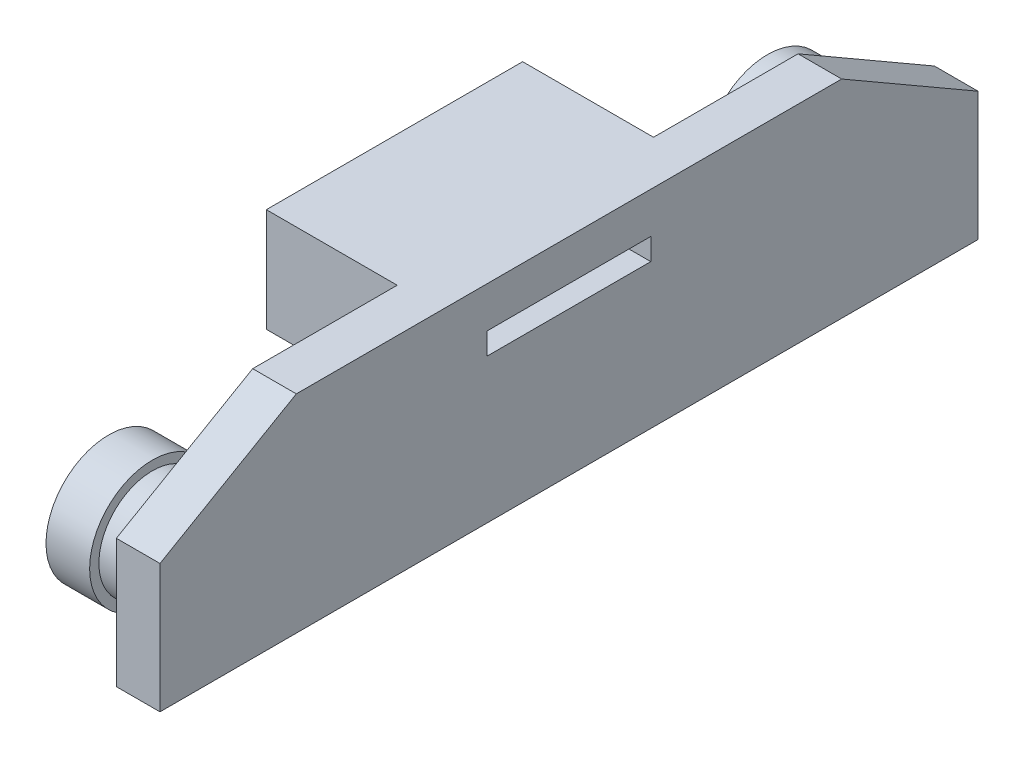
ISO-10303-21;
HEADER;
FILE_DESCRIPTION(('STEP AP214'),'2;1');
FILE_NAME('part.step','',(''),(''),'','','');
FILE_SCHEMA(('AUTOMOTIVE_DESIGN { 1 0 10303 214 1 1 1 1 }'));
ENDSEC;
DATA;
#1=APPLICATION_CONTEXT('core data for automotive mechanical design processes');
#2=APPLICATION_PROTOCOL_DEFINITION('international standard','automotive_design',2000,#1);
#3=PRODUCT_CONTEXT('',#1,'mechanical');
#4=PRODUCT('Part','Part','',(#3));
#5=PRODUCT_RELATED_PRODUCT_CATEGORY('part','',(#4));
#6=PRODUCT_DEFINITION_FORMATION('','',#4);
#7=PRODUCT_DEFINITION_CONTEXT('part definition',#1,'design');
#8=PRODUCT_DEFINITION('design','',#6,#7);
#9=PRODUCT_DEFINITION_SHAPE('','',#8);
#10=(LENGTH_UNIT() NAMED_UNIT(*) SI_UNIT(.MILLI.,.METRE.));
#11=(NAMED_UNIT(*) PLANE_ANGLE_UNIT() SI_UNIT($,.RADIAN.));
#12=(NAMED_UNIT(*) SI_UNIT($,.STERADIAN.) SOLID_ANGLE_UNIT());
#13=UNCERTAINTY_MEASURE_WITH_UNIT(LENGTH_MEASURE(1.E-05),#10,'distance_accuracy_value','');
#14=(GEOMETRIC_REPRESENTATION_CONTEXT(3) GLOBAL_UNCERTAINTY_ASSIGNED_CONTEXT((#13)) GLOBAL_UNIT_ASSIGNED_CONTEXT((#10,
#11,#12)) REPRESENTATION_CONTEXT('',''));
#15=CARTESIAN_POINT('',(0.,0.,0.));
#16=DIRECTION('',(0.,0.,1.));
#17=DIRECTION('',(1.,0.,0.));
#18=AXIS2_PLACEMENT_3D('',#15,#16,#17);
#19=CARTESIAN_POINT('',(-2.032,-1.94510300719157,7.6708));
#20=DIRECTION('',(-1.,0.,0.));
#21=DIRECTION('',(0.,0.,1.));
#22=AXIS2_PLACEMENT_3D('',#19,#20,#21);
#23=PLANE('',#22);
#24=CARTESIAN_POINT('',(-2.032,-1.94510300719157,7.6708));
#25=DIRECTION('',(-1.,0.,0.));
#26=DIRECTION('',(0.,0.,1.));
#27=AXIS2_PLACEMENT_3D('',#24,#25,#26);
#28=CIRCLE('',#27,1.4605);
#29=CARTESIAN_POINT('',(-2.032,-1.94510300719157,9.1313));
#30=VERTEX_POINT('',#29);
#31=EDGE_CURVE('E20',#30,#30,#28,.F.);
#32=ORIENTED_EDGE('',*,*,#31,.F.);
#33=EDGE_LOOP('',(#32));
#34=FACE_BOUND('',#33,.T.);
#35=ADVANCED_FACE('F17',(#34),#23,.T.);
#36=CARTESIAN_POINT('',(-2.032,-1.94510300719157,-7.6708));
#37=DIRECTION('',(-1.,0.,0.));
#38=DIRECTION('',(0.,0.,1.));
#39=AXIS2_PLACEMENT_3D('',#36,#37,#38);
#40=PLANE('',#39);
#41=CARTESIAN_POINT('',(-2.032,-1.94510300719157,-7.6708));
#42=DIRECTION('',(-1.,0.,0.));
#43=DIRECTION('',(0.,0.,1.));
#44=AXIS2_PLACEMENT_3D('',#41,#42,#43);
#45=CIRCLE('',#44,1.4605);
#46=CARTESIAN_POINT('',(-2.032,-1.94510300719157,-6.2103));
#47=VERTEX_POINT('',#46);
#48=EDGE_CURVE('E169',#47,#47,#45,.F.);
#49=ORIENTED_EDGE('',*,*,#48,.F.);
#50=EDGE_LOOP('',(#49));
#51=FACE_BOUND('',#50,.T.);
#52=ADVANCED_FACE('F180',(#51),#40,.T.);
#53=CARTESIAN_POINT('',(-1.016,-1.94510300719157,7.6708));
#54=DIRECTION('',(-1.,0.,0.));
#55=DIRECTION('',(0.,0.,1.));
#56=AXIS2_PLACEMENT_3D('',#53,#54,#55);
#57=CYLINDRICAL_SURFACE('',#56,1.4605);
#58=ORIENTED_EDGE('',*,*,#31,.T.);
#59=EDGE_LOOP('',(#58));
#60=FACE_BOUND('',#59,.T.);
#61=CARTESIAN_POINT('',(-1.016,-1.94510300719157,7.6708));
#62=DIRECTION('',(-1.,0.,0.));
#63=DIRECTION('',(0.,0.,1.));
#64=AXIS2_PLACEMENT_3D('',#61,#62,#63);
#65=CIRCLE('',#64,1.4605);
#66=CARTESIAN_POINT('',(-1.016,-1.94510300719157,9.1313));
#67=VERTEX_POINT('',#66);
#68=EDGE_CURVE('E167',#67,#67,#65,.T.);
#69=ORIENTED_EDGE('',*,*,#68,.T.);
#70=EDGE_LOOP('',(#69));
#71=FACE_BOUND('',#70,.T.);
#72=ADVANCED_FACE('F176',(#60,#71),#57,.T.);
#73=CARTESIAN_POINT('',(-1.016,-1.94510300719157,-7.6708));
#74=DIRECTION('',(-1.,0.,0.));
#75=DIRECTION('',(0.,0.,1.));
#76=AXIS2_PLACEMENT_3D('',#73,#74,#75);
#77=CYLINDRICAL_SURFACE('',#76,1.4605);
#78=ORIENTED_EDGE('',*,*,#48,.T.);
#79=EDGE_LOOP('',(#78));
#80=FACE_BOUND('',#79,.T.);
#81=CARTESIAN_POINT('',(-1.016,-1.94510300719157,-7.6708));
#82=DIRECTION('',(-1.,0.,0.));
#83=DIRECTION('',(0.,0.,1.));
#84=AXIS2_PLACEMENT_3D('',#81,#82,#83);
#85=CIRCLE('',#84,1.4605);
#86=CARTESIAN_POINT('',(-1.016,-1.94510300719157,-6.2103));
#87=VERTEX_POINT('',#86);
#88=EDGE_CURVE('E164',#87,#87,#85,.T.);
#89=ORIENTED_EDGE('',*,*,#88,.T.);
#90=EDGE_LOOP('',(#89));
#91=FACE_BOUND('',#90,.T.);
#92=ADVANCED_FACE('F263',(#80,#91),#77,.T.);
#93=CARTESIAN_POINT('',(-1.016,-1.94510300719157,7.6708));
#94=DIRECTION('',(-1.,0.,0.));
#95=DIRECTION('',(0.,0.,1.));
#96=AXIS2_PLACEMENT_3D('',#93,#94,#95);
#97=PLANE('',#96);
#98=ORIENTED_EDGE('',*,*,#68,.F.);
#99=EDGE_LOOP('',(#98));
#100=FACE_BOUND('',#99,.T.);
#101=CARTESIAN_POINT('',(-1.016,-1.94510300719157,7.6708));
#102=DIRECTION('',(1.,0.,0.));
#103=DIRECTION('',(0.,0.,-1.));
#104=AXIS2_PLACEMENT_3D('',#101,#102,#103);
#105=CIRCLE('',#104,1.2446);
#106=CARTESIAN_POINT('',(-1.016,-1.94510300719157,6.42619999999999));
#107=VERTEX_POINT('',#106);
#108=EDGE_CURVE('E161',#107,#107,#105,.T.);
#109=ORIENTED_EDGE('',*,*,#108,.F.);
#110=EDGE_LOOP('',(#109));
#111=FACE_BOUND('',#110,.T.);
#112=ADVANCED_FACE('F259',(#100,#111),#97,.F.);
#113=CARTESIAN_POINT('',(-1.016,-1.94510300719157,-7.6708));
#114=DIRECTION('',(-1.,0.,0.));
#115=DIRECTION('',(0.,0.,1.));
#116=AXIS2_PLACEMENT_3D('',#113,#114,#115);
#117=PLANE('',#116);
#118=ORIENTED_EDGE('',*,*,#88,.F.);
#119=EDGE_LOOP('',(#118));
#120=FACE_BOUND('',#119,.T.);
#121=CARTESIAN_POINT('',(-1.016,-1.94510300719157,-7.6708));
#122=DIRECTION('',(1.,0.,0.));
#123=DIRECTION('',(0.,0.,-1.));
#124=AXIS2_PLACEMENT_3D('',#121,#122,#123);
#125=CIRCLE('',#124,1.2446);
#126=CARTESIAN_POINT('',(-1.016,-1.94510300719157,-8.9154));
#127=VERTEX_POINT('',#126);
#128=EDGE_CURVE('E152',#127,#127,#125,.T.);
#129=ORIENTED_EDGE('',*,*,#128,.F.);
#130=EDGE_LOOP('',(#129));
#131=FACE_BOUND('',#130,.T.);
#132=ADVANCED_FACE('F255',(#120,#131),#117,.F.);
#133=CARTESIAN_POINT('',(-3.048,-1.94510300719157,7.6708));
#134=DIRECTION('',(1.,0.,0.));
#135=DIRECTION('',(0.,0.,-1.));
#136=AXIS2_PLACEMENT_3D('',#133,#134,#135);
#137=CYLINDRICAL_SURFACE('',#136,1.2446);
#138=CARTESIAN_POINT('',(0.,-1.94510300719157,7.6708));
#139=DIRECTION('',(1.,0.,0.));
#140=DIRECTION('',(0.,0.,-1.));
#141=AXIS2_PLACEMENT_3D('',#138,#139,#140);
#142=CIRCLE('',#141,1.2446);
#143=CARTESIAN_POINT('',(0.,-1.94510300719157,6.42619999999999));
#144=VERTEX_POINT('',#143);
#145=EDGE_CURVE('E156',#144,#144,#142,.F.);
#146=ORIENTED_EDGE('',*,*,#145,.T.);
#147=EDGE_LOOP('',(#146));
#148=FACE_BOUND('',#147,.T.);
#149=ORIENTED_EDGE('',*,*,#108,.T.);
#150=EDGE_LOOP('',(#149));
#151=FACE_BOUND('',#150,.T.);
#152=ADVANCED_FACE('F251',(#148,#151),#137,.T.);
#153=CARTESIAN_POINT('',(-3.048,-1.94510300719157,-7.6708));
#154=DIRECTION('',(1.,0.,0.));
#155=DIRECTION('',(0.,0.,-1.));
#156=AXIS2_PLACEMENT_3D('',#153,#154,#155);
#157=CYLINDRICAL_SURFACE('',#156,1.2446);
#158=CARTESIAN_POINT('',(0.,-1.94510300719157,-7.6708));
#159=DIRECTION('',(1.,0.,0.));
#160=DIRECTION('',(0.,0.,-1.));
#161=AXIS2_PLACEMENT_3D('',#158,#159,#160);
#162=CIRCLE('',#161,1.2446);
#163=CARTESIAN_POINT('',(0.,-1.94510300719157,-8.9154));
#164=VERTEX_POINT('',#163);
#165=EDGE_CURVE('E153',#164,#164,#162,.F.);
#166=ORIENTED_EDGE('',*,*,#165,.T.);
#167=EDGE_LOOP('',(#166));
#168=FACE_BOUND('',#167,.T.);
#169=ORIENTED_EDGE('',*,*,#128,.T.);
#170=EDGE_LOOP('',(#169));
#171=FACE_BOUND('',#170,.T.);
#172=ADVANCED_FACE('F248',(#168,#171),#157,.T.);
#173=CARTESIAN_POINT('',(-3.048,-1.2065,2.9845));
#174=DIRECTION('',(0.,-1.,0.));
#175=DIRECTION('',(0.,0.,-1.));
#176=AXIS2_PLACEMENT_3D('',#173,#174,#175);
#177=PLANE('',#176);
#178=DIRECTION('',(0.,0.,-1.));
#179=VECTOR('',#178,1.);
#180=CARTESIAN_POINT('',(-3.048,-1.2065,-2.9845));
#181=LINE('',#180,#179);
#182=CARTESIAN_POINT('',(-3.048,-1.2065,2.9845));
#183=VERTEX_POINT('',#182);
#184=CARTESIAN_POINT('',(-3.048,-1.2065,-2.9845));
#185=VERTEX_POINT('',#184);
#186=EDGE_CURVE('E115',#183,#185,#181,.T.);
#187=ORIENTED_EDGE('',*,*,#186,.T.);
#188=DIRECTION('',(-1.,0.,0.));
#189=VECTOR('',#188,1.);
#190=CARTESIAN_POINT('',(-3.048,-1.2065,-2.9845));
#191=LINE('',#190,#189);
#192=CARTESIAN_POINT('',(0.,-1.2065,-2.9845));
#193=VERTEX_POINT('',#192);
#194=EDGE_CURVE('E120',#193,#185,#191,.T.);
#195=ORIENTED_EDGE('',*,*,#194,.F.);
#196=DIRECTION('',(0.,0.,-1.));
#197=VECTOR('',#196,1.);
#198=CARTESIAN_POINT('',(0.,-1.2065,9.52499999999999));
#199=LINE('',#198,#197);
#200=CARTESIAN_POINT('',(0.,-1.2065,2.9845));
#201=VERTEX_POINT('',#200);
#202=EDGE_CURVE('E502',#193,#201,#199,.F.);
#203=ORIENTED_EDGE('',*,*,#202,.T.);
#204=DIRECTION('',(1.,0.,0.));
#205=VECTOR('',#204,1.);
#206=CARTESIAN_POINT('',(-3.048,-1.2065,2.9845));
#207=LINE('',#206,#205);
#208=EDGE_CURVE('E123',#183,#201,#207,.T.);
#209=ORIENTED_EDGE('',*,*,#208,.F.);
#210=EDGE_LOOP('',(#187,#195,#203,#209));
#211=FACE_BOUND('',#210,.T.);
#212=ADVANCED_FACE('F119',(#211),#177,.T.);
#213=CARTESIAN_POINT('',(1.016,-0.254,-1.905));
#214=DIRECTION('',(0.,0.,-1.));
#215=DIRECTION('',(-1.,0.,0.));
#216=AXIS2_PLACEMENT_3D('',#213,#214,#215);
#217=PLANE('',#216);
#218=DIRECTION('',(1.,0.,0.));
#219=VECTOR('',#218,1.);
#220=CARTESIAN_POINT('',(1.016,-0.254,-1.905));
#221=LINE('',#220,#219);
#222=CARTESIAN_POINT('',(-3.048,-0.254,-1.905));
#223=VERTEX_POINT('',#222);
#224=CARTESIAN_POINT('',(1.016,-0.254,-1.905));
#225=VERTEX_POINT('',#224);
#226=EDGE_CURVE('E430',#223,#225,#221,.T.);
#227=ORIENTED_EDGE('',*,*,#226,.T.);
#228=DIRECTION('',(0.,1.,0.));
#229=VECTOR('',#228,1.);
#230=CARTESIAN_POINT('',(1.016,-0.254,-1.905));
#231=LINE('',#230,#229);
#232=CARTESIAN_POINT('',(1.016,0.254,-1.905));
#233=VERTEX_POINT('',#232);
#234=EDGE_CURVE('E150',#233,#225,#231,.F.);
#235=ORIENTED_EDGE('',*,*,#234,.F.);
#236=DIRECTION('',(1.,0.,0.));
#237=VECTOR('',#236,1.);
#238=CARTESIAN_POINT('',(1.016,0.254,-1.905));
#239=LINE('',#238,#237);
#240=CARTESIAN_POINT('',(-3.048,0.254,-1.905));
#241=VERTEX_POINT('',#240);
#242=EDGE_CURVE('E495',#233,#241,#239,.F.);
#243=ORIENTED_EDGE('',*,*,#242,.T.);
#244=DIRECTION('',(0.,1.,0.));
#245=VECTOR('',#244,1.);
#246=CARTESIAN_POINT('',(-3.048,-1.2065,-1.905));
#247=LINE('',#246,#245);
#248=EDGE_CURVE('E134',#241,#223,#247,.F.);
#249=ORIENTED_EDGE('',*,*,#248,.T.);
#250=EDGE_LOOP('',(#227,#235,#243,#249));
#251=FACE_BOUND('',#250,.T.);
#252=ADVANCED_FACE('F241',(#251),#217,.F.);
#253=CARTESIAN_POINT('',(1.016,-0.254,1.905));
#254=DIRECTION('',(0.,0.,1.));
#255=DIRECTION('',(1.,0.,0.));
#256=AXIS2_PLACEMENT_3D('',#253,#254,#255);
#257=PLANE('',#256);
#258=DIRECTION('',(1.,0.,0.));
#259=VECTOR('',#258,1.);
#260=CARTESIAN_POINT('',(1.016,0.254,1.905));
#261=LINE('',#260,#259);
#262=CARTESIAN_POINT('',(-3.048,0.254,1.905));
#263=VERTEX_POINT('',#262);
#264=CARTESIAN_POINT('',(1.016,0.254,1.905));
#265=VERTEX_POINT('',#264);
#266=EDGE_CURVE('E497',#263,#265,#261,.T.);
#267=ORIENTED_EDGE('',*,*,#266,.T.);
#268=DIRECTION('',(0.,1.,0.));
#269=VECTOR('',#268,1.);
#270=CARTESIAN_POINT('',(1.016,-0.254,1.905));
#271=LINE('',#270,#269);
#272=CARTESIAN_POINT('',(1.016,-0.254,1.905));
#273=VERTEX_POINT('',#272);
#274=EDGE_CURVE('E135',#273,#265,#271,.T.);
#275=ORIENTED_EDGE('',*,*,#274,.F.);
#276=DIRECTION('',(1.,0.,0.));
#277=VECTOR('',#276,1.);
#278=CARTESIAN_POINT('',(1.016,-0.254,1.905));
#279=LINE('',#278,#277);
#280=CARTESIAN_POINT('',(-3.048,-0.254,1.905));
#281=VERTEX_POINT('',#280);
#282=EDGE_CURVE('E436',#273,#281,#279,.F.);
#283=ORIENTED_EDGE('',*,*,#282,.T.);
#284=DIRECTION('',(0.,1.,0.));
#285=VECTOR('',#284,1.);
#286=CARTESIAN_POINT('',(-3.048,-1.2065,1.905));
#287=LINE('',#286,#285);
#288=EDGE_CURVE('E126',#281,#263,#287,.T.);
#289=ORIENTED_EDGE('',*,*,#288,.T.);
#290=EDGE_LOOP('',(#267,#275,#283,#289));
#291=FACE_BOUND('',#290,.T.);
#292=ADVANCED_FACE('F238',(#291),#257,.F.);
#293=CARTESIAN_POINT('',(-3.048,1.2065,-2.9845));
#294=DIRECTION('',(0.,0.,-1.));
#295=DIRECTION('',(-1.,0.,0.));
#296=AXIS2_PLACEMENT_3D('',#293,#294,#295);
#297=PLANE('',#296);
#298=DIRECTION('',(0.,1.,0.));
#299=VECTOR('',#298,1.);
#300=CARTESIAN_POINT('',(-3.048,-1.2065,-2.9845));
#301=LINE('',#300,#299);
#302=CARTESIAN_POINT('',(-3.048,1.2065,-2.9845));
#303=VERTEX_POINT('',#302);
#304=EDGE_CURVE('E125',#185,#303,#301,.T.);
#305=ORIENTED_EDGE('',*,*,#304,.T.);
#306=DIRECTION('',(1.,0.,0.));
#307=VECTOR('',#306,1.);
#308=CARTESIAN_POINT('',(-3.048,1.2065,-2.9845));
#309=LINE('',#308,#307);
#310=CARTESIAN_POINT('',(0.,1.2065,-2.9845));
#311=VERTEX_POINT('',#310);
#312=EDGE_CURVE('E475',#311,#303,#309,.F.);
#313=ORIENTED_EDGE('',*,*,#312,.F.);
#314=DIRECTION('',(0.,1.,0.));
#315=VECTOR('',#314,1.);
#316=CARTESIAN_POINT('',(0.,1.2065,-2.9845));
#317=LINE('',#316,#315);
#318=EDGE_CURVE('E132',#311,#193,#317,.F.);
#319=ORIENTED_EDGE('',*,*,#318,.T.);
#320=ORIENTED_EDGE('',*,*,#194,.T.);
#321=EDGE_LOOP('',(#305,#313,#319,#320));
#322=FACE_BOUND('',#321,.T.);
#323=ADVANCED_FACE('F129',(#322),#297,.T.);
#324=CARTESIAN_POINT('',(-3.048,-1.2065,-2.9845));
#325=DIRECTION('',(1.,0.,0.));
#326=DIRECTION('',(0.,0.,-1.));
#327=AXIS2_PLACEMENT_3D('',#324,#325,#326);
#328=PLANE('',#327);
#329=ORIENTED_EDGE('',*,*,#186,.F.);
#330=DIRECTION('',(0.,1.,0.));
#331=VECTOR('',#330,1.);
#332=CARTESIAN_POINT('',(-3.048,1.2065,2.9845));
#333=LINE('',#332,#331);
#334=CARTESIAN_POINT('',(-3.048,1.2065,2.9845));
#335=VERTEX_POINT('',#334);
#336=EDGE_CURVE('E142',#335,#183,#333,.F.);
#337=ORIENTED_EDGE('',*,*,#336,.F.);
#338=DIRECTION('',(0.,0.,1.));
#339=VECTOR('',#338,1.);
#340=CARTESIAN_POINT('',(-3.048,1.2065,2.9845));
#341=LINE('',#340,#339);
#342=EDGE_CURVE('E140',#303,#335,#341,.T.);
#343=ORIENTED_EDGE('',*,*,#342,.F.);
#344=ORIENTED_EDGE('',*,*,#304,.F.);
#345=EDGE_LOOP('',(#329,#337,#343,#344));
#346=FACE_BOUND('',#345,.T.);
#347=ORIENTED_EDGE('',*,*,#288,.F.);
#348=DIRECTION('',(0.,0.,-1.));
#349=VECTOR('',#348,1.);
#350=CARTESIAN_POINT('',(-3.048,-0.254,-1.905));
#351=LINE('',#350,#349);
#352=EDGE_CURVE('E490',#281,#223,#351,.T.);
#353=ORIENTED_EDGE('',*,*,#352,.T.);
#354=ORIENTED_EDGE('',*,*,#248,.F.);
#355=DIRECTION('',(0.,0.,1.));
#356=VECTOR('',#355,1.);
#357=CARTESIAN_POINT('',(-3.048,0.254,-1.905));
#358=LINE('',#357,#356);
#359=EDGE_CURVE('E437',#241,#263,#358,.T.);
#360=ORIENTED_EDGE('',*,*,#359,.T.);
#361=EDGE_LOOP('',(#347,#353,#354,#360));
#362=FACE_BOUND('',#361,.T.);
#363=ADVANCED_FACE('F137',(#346,#362),#328,.F.);
#364=CARTESIAN_POINT('',(-3.048,1.2065,2.9845));
#365=DIRECTION('',(0.,0.,1.));
#366=DIRECTION('',(1.,0.,0.));
#367=AXIS2_PLACEMENT_3D('',#364,#365,#366);
#368=PLANE('',#367);
#369=ORIENTED_EDGE('',*,*,#336,.T.);
#370=ORIENTED_EDGE('',*,*,#208,.T.);
#371=DIRECTION('',(0.,1.,0.));
#372=VECTOR('',#371,1.);
#373=CARTESIAN_POINT('',(0.,1.2065,2.9845));
#374=LINE('',#373,#372);
#375=CARTESIAN_POINT('',(0.,1.2065,2.9845));
#376=VERTEX_POINT('',#375);
#377=EDGE_CURVE('E500',#201,#376,#374,.T.);
#378=ORIENTED_EDGE('',*,*,#377,.T.);
#379=DIRECTION('',(1.,0.,0.));
#380=VECTOR('',#379,1.);
#381=CARTESIAN_POINT('',(-3.048,1.2065,2.9845));
#382=LINE('',#381,#380);
#383=EDGE_CURVE('E471',#335,#376,#382,.T.);
#384=ORIENTED_EDGE('',*,*,#383,.F.);
#385=EDGE_LOOP('',(#369,#370,#378,#384));
#386=FACE_BOUND('',#385,.T.);
#387=ADVANCED_FACE('F229',(#386),#368,.T.);
#388=CARTESIAN_POINT('',(0.,1.2065,9.52499999999999));
#389=DIRECTION('',(1.,0.,0.));
#390=DIRECTION('',(0.,0.,-1.));
#391=AXIS2_PLACEMENT_3D('',#388,#389,#390);
#392=PLANE('',#391);
#393=DIRECTION('',(0.,0.499999999999998,0.86602540378444));
#394=VECTOR('',#393,1.);
#395=CARTESIAN_POINT('',(0.,1.2065,-6.34999999999998));
#396=LINE('',#395,#394);
#397=CARTESIAN_POINT('',(0.,-0.626587104677061,-9.525));
#398=VERTEX_POINT('',#397);
#399=CARTESIAN_POINT('',(0.,1.2065,-6.34999999999998));
#400=VERTEX_POINT('',#399);
#401=EDGE_CURVE('E483',#398,#400,#396,.T.);
#402=ORIENTED_EDGE('',*,*,#401,.F.);
#403=DIRECTION('',(0.,1.,0.));
#404=VECTOR('',#403,1.);
#405=CARTESIAN_POINT('',(0.,-3.6195,-9.525));
#406=LINE('',#405,#404);
#407=CARTESIAN_POINT('',(0.,-3.6195,-9.525));
#408=VERTEX_POINT('',#407);
#409=EDGE_CURVE('E488',#398,#408,#406,.F.);
#410=ORIENTED_EDGE('',*,*,#409,.T.);
#411=DIRECTION('',(0.,0.,1.));
#412=VECTOR('',#411,1.);
#413=CARTESIAN_POINT('',(0.,-3.6195,-9.525));
#414=LINE('',#413,#412);
#415=CARTESIAN_POINT('',(0.,-3.6195,9.525));
#416=VERTEX_POINT('',#415);
#417=EDGE_CURVE('E449',#408,#416,#414,.T.);
#418=ORIENTED_EDGE('',*,*,#417,.T.);
#419=DIRECTION('',(0.,1.,0.));
#420=VECTOR('',#419,1.);
#421=CARTESIAN_POINT('',(0.,-3.6195,9.525));
#422=LINE('',#421,#420);
#423=CARTESIAN_POINT('',(0.,-0.626587104677062,9.525));
#424=VERTEX_POINT('',#423);
#425=EDGE_CURVE('E461',#416,#424,#422,.T.);
#426=ORIENTED_EDGE('',*,*,#425,.T.);
#427=DIRECTION('',(0.,-0.499999999999998,0.86602540378444));
#428=VECTOR('',#427,1.);
#429=CARTESIAN_POINT('',(0.,-0.626587104677061,9.525));
#430=LINE('',#429,#428);
#431=CARTESIAN_POINT('',(0.,1.2065,6.34999999999997));
#432=VERTEX_POINT('',#431);
#433=EDGE_CURVE('E463',#432,#424,#430,.T.);
#434=ORIENTED_EDGE('',*,*,#433,.F.);
#435=DIRECTION('',(0.,0.,1.));
#436=VECTOR('',#435,1.);
#437=CARTESIAN_POINT('',(0.,1.2065,2.9845));
#438=LINE('',#437,#436);
#439=EDGE_CURVE('E469',#376,#432,#438,.T.);
#440=ORIENTED_EDGE('',*,*,#439,.F.);
#441=ORIENTED_EDGE('',*,*,#377,.F.);
#442=ORIENTED_EDGE('',*,*,#202,.F.);
#443=ORIENTED_EDGE('',*,*,#318,.F.);
#444=DIRECTION('',(0.,0.,1.));
#445=VECTOR('',#444,1.);
#446=CARTESIAN_POINT('',(0.,1.2065,2.9845));
#447=LINE('',#446,#445);
#448=EDGE_CURVE('E477',#400,#311,#447,.T.);
#449=ORIENTED_EDGE('',*,*,#448,.F.);
#450=EDGE_LOOP('',(#402,#410,#418,#426,#434,#440,#441,#442,#443,#449));
#451=FACE_BOUND('',#450,.T.);
#452=ORIENTED_EDGE('',*,*,#165,.F.);
#453=EDGE_LOOP('',(#452));
#454=FACE_BOUND('',#453,.T.);
#455=ORIENTED_EDGE('',*,*,#145,.F.);
#456=EDGE_LOOP('',(#455));
#457=FACE_BOUND('',#456,.T.);
#458=ADVANCED_FACE('F225',(#451,#454,#457),#392,.F.);
#459=CARTESIAN_POINT('',(1.016,0.254,-1.905));
#460=DIRECTION('',(0.,1.,0.));
#461=DIRECTION('',(0.,0.,1.));
#462=AXIS2_PLACEMENT_3D('',#459,#460,#461);
#463=PLANE('',#462);
#464=ORIENTED_EDGE('',*,*,#242,.F.);
#465=DIRECTION('',(0.,0.,-1.));
#466=VECTOR('',#465,1.);
#467=CARTESIAN_POINT('',(1.016,0.254,9.52499999999999));
#468=LINE('',#467,#466);
#469=EDGE_CURVE('E443',#265,#233,#468,.T.);
#470=ORIENTED_EDGE('',*,*,#469,.F.);
#471=ORIENTED_EDGE('',*,*,#266,.F.);
#472=ORIENTED_EDGE('',*,*,#359,.F.);
#473=EDGE_LOOP('',(#464,#470,#471,#472));
#474=FACE_BOUND('',#473,.T.);
#475=ADVANCED_FACE('F221',(#474),#463,.F.);
#476=CARTESIAN_POINT('',(1.016,-0.254,-1.905));
#477=DIRECTION('',(0.,-1.,0.));
#478=DIRECTION('',(0.,0.,-1.));
#479=AXIS2_PLACEMENT_3D('',#476,#477,#478);
#480=PLANE('',#479);
#481=ORIENTED_EDGE('',*,*,#282,.F.);
#482=DIRECTION('',(0.,0.,-1.));
#483=VECTOR('',#482,1.);
#484=CARTESIAN_POINT('',(1.016,-0.254,9.52499999999999));
#485=LINE('',#484,#483);
#486=EDGE_CURVE('E441',#225,#273,#485,.F.);
#487=ORIENTED_EDGE('',*,*,#486,.F.);
#488=ORIENTED_EDGE('',*,*,#226,.F.);
#489=ORIENTED_EDGE('',*,*,#352,.F.);
#490=EDGE_LOOP('',(#481,#487,#488,#489));
#491=FACE_BOUND('',#490,.T.);
#492=ADVANCED_FACE('F217',(#491),#480,.F.);
#493=CARTESIAN_POINT('',(1.016,-3.6195,-9.525));
#494=DIRECTION('',(0.,0.,1.));
#495=DIRECTION('',(1.,0.,0.));
#496=AXIS2_PLACEMENT_3D('',#493,#494,#495);
#497=PLANE('',#496);
#498=DIRECTION('',(1.,0.,0.));
#499=VECTOR('',#498,1.);
#500=CARTESIAN_POINT('',(-3.048,-0.62658710467706,-9.525));
#501=LINE('',#500,#499);
#502=CARTESIAN_POINT('',(1.016,-0.626587104677061,-9.525));
#503=VERTEX_POINT('',#502);
#504=EDGE_CURVE('E485',#503,#398,#501,.F.);
#505=ORIENTED_EDGE('',*,*,#504,.F.);
#506=DIRECTION('',(0.,1.,0.));
#507=VECTOR('',#506,1.);
#508=CARTESIAN_POINT('',(1.016,1.2065,-9.525));
#509=LINE('',#508,#507);
#510=CARTESIAN_POINT('',(1.016,-3.6195,-9.525));
#511=VERTEX_POINT('',#510);
#512=EDGE_CURVE('E442',#511,#503,#509,.T.);
#513=ORIENTED_EDGE('',*,*,#512,.F.);
#514=DIRECTION('',(1.,0.,0.));
#515=VECTOR('',#514,1.);
#516=CARTESIAN_POINT('',(1.016,-3.6195,-9.525));
#517=LINE('',#516,#515);
#518=EDGE_CURVE('E455',#511,#408,#517,.F.);
#519=ORIENTED_EDGE('',*,*,#518,.T.);
#520=ORIENTED_EDGE('',*,*,#409,.F.);
#521=EDGE_LOOP('',(#505,#513,#519,#520));
#522=FACE_BOUND('',#521,.T.);
#523=ADVANCED_FACE('F213',(#522),#497,.F.);
#524=CARTESIAN_POINT('',(-3.048,1.2065,-6.34999999999998));
#525=DIRECTION('',(0.,0.86602540378444,-0.499999999999998));
#526=DIRECTION('',(0.,0.499999999999998,0.86602540378444));
#527=AXIS2_PLACEMENT_3D('',#524,#525,#526);
#528=PLANE('',#527);
#529=ORIENTED_EDGE('',*,*,#401,.T.);
#530=DIRECTION('',(1.,0.,0.));
#531=VECTOR('',#530,1.);
#532=CARTESIAN_POINT('',(-3.048,1.2065,-6.34999999999998));
#533=LINE('',#532,#531);
#534=CARTESIAN_POINT('',(1.016,1.2065,-6.34999999999998));
#535=VERTEX_POINT('',#534);
#536=EDGE_CURVE('E480',#535,#400,#533,.F.);
#537=ORIENTED_EDGE('',*,*,#536,.F.);
#538=DIRECTION('',(0.,0.499999999999998,0.86602540378444));
#539=VECTOR('',#538,1.);
#540=CARTESIAN_POINT('',(1.016,-0.626587104677061,-9.525));
#541=LINE('',#540,#539);
#542=EDGE_CURVE('E446',#503,#535,#541,.T.);
#543=ORIENTED_EDGE('',*,*,#542,.F.);
#544=ORIENTED_EDGE('',*,*,#504,.T.);
#545=EDGE_LOOP('',(#529,#537,#543,#544));
#546=FACE_BOUND('',#545,.T.);
#547=ADVANCED_FACE('F209',(#546),#528,.T.);
#548=CARTESIAN_POINT('',(-3.048,1.2065,2.9845));
#549=DIRECTION('',(0.,1.,0.));
#550=DIRECTION('',(0.,0.,1.));
#551=AXIS2_PLACEMENT_3D('',#548,#549,#550);
#552=PLANE('',#551);
#553=ORIENTED_EDGE('',*,*,#439,.T.);
#554=DIRECTION('',(1.,0.,0.));
#555=VECTOR('',#554,1.);
#556=CARTESIAN_POINT('',(1.016,1.20650000000001,6.34999999999996));
#557=LINE('',#556,#555);
#558=CARTESIAN_POINT('',(1.016,1.2065,6.34999999999997));
#559=VERTEX_POINT('',#558);
#560=EDGE_CURVE('E466',#559,#432,#557,.F.);
#561=ORIENTED_EDGE('',*,*,#560,.F.);
#562=DIRECTION('',(0.,0.,-1.));
#563=VECTOR('',#562,1.);
#564=CARTESIAN_POINT('',(1.016,1.2065,9.52499999999999));
#565=LINE('',#564,#563);
#566=EDGE_CURVE('E521',#535,#559,#565,.F.);
#567=ORIENTED_EDGE('',*,*,#566,.F.);
#568=ORIENTED_EDGE('',*,*,#536,.T.);
#569=ORIENTED_EDGE('',*,*,#448,.T.);
#570=ORIENTED_EDGE('',*,*,#312,.T.);
#571=ORIENTED_EDGE('',*,*,#342,.T.);
#572=ORIENTED_EDGE('',*,*,#383,.T.);
#573=EDGE_LOOP('',(#553,#561,#567,#568,#569,#570,#571,#572));
#574=FACE_BOUND('',#573,.T.);
#575=ADVANCED_FACE('F205',(#574),#552,.T.);
#576=CARTESIAN_POINT('',(1.016,-0.626587104677061,9.525));
#577=DIRECTION('',(0.,0.86602540378444,0.499999999999998));
#578=DIRECTION('',(0.,-0.499999999999998,0.86602540378444));
#579=AXIS2_PLACEMENT_3D('',#576,#577,#578);
#580=PLANE('',#579);
#581=ORIENTED_EDGE('',*,*,#433,.T.);
#582=DIRECTION('',(1.,0.,0.));
#583=VECTOR('',#582,1.);
#584=CARTESIAN_POINT('',(1.016,-0.626587104677062,9.525));
#585=LINE('',#584,#583);
#586=CARTESIAN_POINT('',(1.016,-0.626587104677062,9.525));
#587=VERTEX_POINT('',#586);
#588=EDGE_CURVE('E459',#424,#587,#585,.T.);
#589=ORIENTED_EDGE('',*,*,#588,.T.);
#590=DIRECTION('',(0.,-0.499999999999996,0.866025403784441));
#591=VECTOR('',#590,1.);
#592=CARTESIAN_POINT('',(1.016,1.20650000000001,6.34999999999996));
#593=LINE('',#592,#591);
#594=EDGE_CURVE('E518',#559,#587,#593,.T.);
#595=ORIENTED_EDGE('',*,*,#594,.F.);
#596=ORIENTED_EDGE('',*,*,#560,.T.);
#597=EDGE_LOOP('',(#581,#589,#595,#596));
#598=FACE_BOUND('',#597,.T.);
#599=ADVANCED_FACE('F202',(#598),#580,.T.);
#600=CARTESIAN_POINT('',(1.016,-3.6195,9.525));
#601=DIRECTION('',(0.,0.,-1.));
#602=DIRECTION('',(0.,1.,0.));
#603=AXIS2_PLACEMENT_3D('',#600,#601,#602);
#604=PLANE('',#603);
#605=ORIENTED_EDGE('',*,*,#588,.F.);
#606=ORIENTED_EDGE('',*,*,#425,.F.);
#607=DIRECTION('',(1.,0.,0.));
#608=VECTOR('',#607,1.);
#609=CARTESIAN_POINT('',(1.016,-3.6195,9.525));
#610=LINE('',#609,#608);
#611=CARTESIAN_POINT('',(1.016,-3.6195,9.525));
#612=VERTEX_POINT('',#611);
#613=EDGE_CURVE('E35',#416,#612,#610,.T.);
#614=ORIENTED_EDGE('',*,*,#613,.T.);
#615=DIRECTION('',(0.,1.,0.));
#616=VECTOR('',#615,1.);
#617=CARTESIAN_POINT('',(1.016,1.2065,9.525));
#618=LINE('',#617,#616);
#619=EDGE_CURVE('E26',#587,#612,#618,.F.);
#620=ORIENTED_EDGE('',*,*,#619,.F.);
#621=EDGE_LOOP('',(#605,#606,#614,#620));
#622=FACE_BOUND('',#621,.T.);
#623=ADVANCED_FACE('F194',(#622),#604,.F.);
#624=CARTESIAN_POINT('',(1.016,-3.6195,-9.525));
#625=DIRECTION('',(0.,1.,0.));
#626=DIRECTION('',(0.,0.,1.));
#627=AXIS2_PLACEMENT_3D('',#624,#625,#626);
#628=PLANE('',#627);
#629=ORIENTED_EDGE('',*,*,#518,.F.);
#630=DIRECTION('',(0.,0.,-1.));
#631=VECTOR('',#630,1.);
#632=CARTESIAN_POINT('',(1.016,-3.6195,9.52499999999999));
#633=LINE('',#632,#631);
#634=EDGE_CURVE('E11',#612,#511,#633,.T.);
#635=ORIENTED_EDGE('',*,*,#634,.F.);
#636=ORIENTED_EDGE('',*,*,#613,.F.);
#637=ORIENTED_EDGE('',*,*,#417,.F.);
#638=EDGE_LOOP('',(#629,#635,#636,#637));
#639=FACE_BOUND('',#638,.T.);
#640=ADVANCED_FACE('F188',(#639),#628,.F.);
#641=CARTESIAN_POINT('',(1.016,1.2065,9.52499999999999));
#642=DIRECTION('',(1.,0.,0.));
#643=DIRECTION('',(0.,0.,-1.));
#644=AXIS2_PLACEMENT_3D('',#641,#642,#643);
#645=PLANE('',#644);
#646=ORIENTED_EDGE('',*,*,#619,.T.);
#647=ORIENTED_EDGE('',*,*,#634,.T.);
#648=ORIENTED_EDGE('',*,*,#512,.T.);
#649=ORIENTED_EDGE('',*,*,#542,.T.);
#650=ORIENTED_EDGE('',*,*,#566,.T.);
#651=ORIENTED_EDGE('',*,*,#594,.T.);
#652=EDGE_LOOP('',(#646,#647,#648,#649,#650,#651));
#653=FACE_BOUND('',#652,.T.);
#654=ORIENTED_EDGE('',*,*,#234,.T.);
#655=ORIENTED_EDGE('',*,*,#486,.T.);
#656=ORIENTED_EDGE('',*,*,#274,.T.);
#657=ORIENTED_EDGE('',*,*,#469,.T.);
#658=EDGE_LOOP('',(#654,#655,#656,#657));
#659=FACE_BOUND('',#658,.T.);
#660=ADVANCED_FACE('F186',(#653,#659),#645,.T.);
#661=CLOSED_SHELL('',(#35,#52,#72,#92,#112,#132,#152,#172,#212,#252,#292,#323,#363,#387,#458,
#475,#492,#523,#547,#575,#599,#623,#640,#660));
#662=MANIFOLD_SOLID_BREP('B1',#661);
#663=ADVANCED_BREP_SHAPE_REPRESENTATION('',(#18,#662),#14);
#664=SHAPE_DEFINITION_REPRESENTATION(#9,#663);
ENDSEC;
END-ISO-10303-21;
